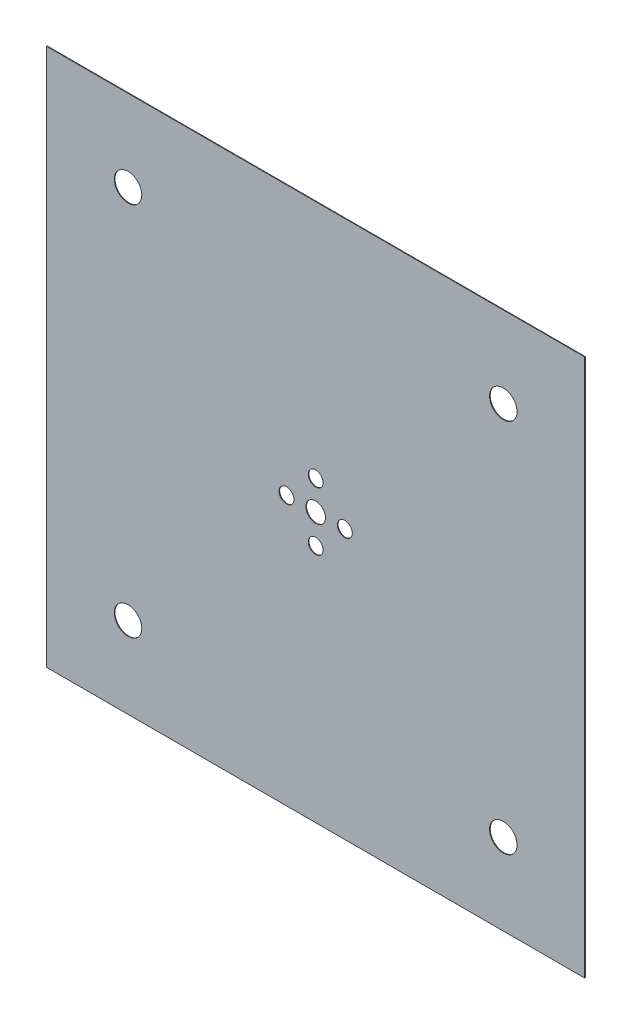
ISO-10303-21;
HEADER;
FILE_DESCRIPTION(('STEP AP214'),'2;1');
FILE_NAME('part.step','',(''),(''),'','','');
FILE_SCHEMA(('AUTOMOTIVE_DESIGN { 1 0 10303 214 1 1 1 1 }'));
ENDSEC;
DATA;
#1=APPLICATION_CONTEXT('core data for automotive mechanical design processes');
#2=APPLICATION_PROTOCOL_DEFINITION('international standard','automotive_design',2000,#1);
#3=PRODUCT_CONTEXT('',#1,'mechanical');
#4=PRODUCT('Part','Part','',(#3));
#5=PRODUCT_RELATED_PRODUCT_CATEGORY('part','',(#4));
#6=PRODUCT_DEFINITION_FORMATION('','',#4);
#7=PRODUCT_DEFINITION_CONTEXT('part definition',#1,'design');
#8=PRODUCT_DEFINITION('design','',#6,#7);
#9=PRODUCT_DEFINITION_SHAPE('','',#8);
#10=(LENGTH_UNIT() NAMED_UNIT(*) SI_UNIT(.MILLI.,.METRE.));
#11=(NAMED_UNIT(*) PLANE_ANGLE_UNIT() SI_UNIT($,.RADIAN.));
#12=(NAMED_UNIT(*) SI_UNIT($,.STERADIAN.) SOLID_ANGLE_UNIT());
#13=UNCERTAINTY_MEASURE_WITH_UNIT(LENGTH_MEASURE(1.E-05),#10,'distance_accuracy_value','');
#14=(GEOMETRIC_REPRESENTATION_CONTEXT(3) GLOBAL_UNCERTAINTY_ASSIGNED_CONTEXT((#13)) GLOBAL_UNIT_ASSIGNED_CONTEXT((#10,
#11,#12)) REPRESENTATION_CONTEXT('',''));
#15=CARTESIAN_POINT('',(0.,0.,0.));
#16=DIRECTION('',(0.,0.,1.));
#17=DIRECTION('',(1.,0.,0.));
#18=AXIS2_PLACEMENT_3D('',#15,#16,#17);
#19=CARTESIAN_POINT('',(0.,0.,3.));
#20=DIRECTION('',(0.,0.,1.));
#21=DIRECTION('',(1.,0.,0.));
#22=AXIS2_PLACEMENT_3D('',#19,#20,#21);
#23=PLANE('',#22);
#24=CARTESIAN_POINT('',(5.82867087928207E-13,-140.,3.));
#25=DIRECTION('',(0.,0.,1.));
#26=DIRECTION('',(1.,0.,0.));
#27=AXIS2_PLACEMENT_3D('',#24,#25,#26);
#28=CIRCLE('',#27,35.6375000000004);
#29=CARTESIAN_POINT('',(35.637500000001,-140.,3.));
#30=VERTEX_POINT('',#29);
#31=EDGE_CURVE('E157',#30,#30,#28,.T.);
#32=ORIENTED_EDGE('',*,*,#31,.F.);
#33=EDGE_LOOP('',(#32));
#34=FACE_BOUND('',#33,.T.);
#35=CARTESIAN_POINT('',(900.,-900.,3.));
#36=DIRECTION('',(0.,0.,1.));
#37=DIRECTION('',(-1.,0.,0.));
#38=AXIS2_PLACEMENT_3D('',#35,#36,#37);
#39=CIRCLE('',#38,65.7999999999998);
#40=CARTESIAN_POINT('',(834.2,-900.,3.));
#41=VERTEX_POINT('',#40);
#42=EDGE_CURVE('E145',#41,#41,#39,.T.);
#43=ORIENTED_EDGE('',*,*,#42,.F.);
#44=EDGE_LOOP('',(#43));
#45=FACE_BOUND('',#44,.T.);
#46=CARTESIAN_POINT('',(899.999999999999,900.000000000001,3.));
#47=DIRECTION('',(0.,0.,1.));
#48=DIRECTION('',(-1.,0.,0.));
#49=AXIS2_PLACEMENT_3D('',#46,#47,#48);
#50=CIRCLE('',#49,65.8000000000001);
#51=CARTESIAN_POINT('',(834.199999999999,900.000000000001,3.));
#52=VERTEX_POINT('',#51);
#53=EDGE_CURVE('E133',#52,#52,#50,.T.);
#54=ORIENTED_EDGE('',*,*,#53,.F.);
#55=EDGE_LOOP('',(#54));
#56=FACE_BOUND('',#55,.T.);
#57=CARTESIAN_POINT('',(1.40834381901945E-13,140.,3.));
#58=DIRECTION('',(0.,0.,1.));
#59=DIRECTION('',(1.,0.,0.));
#60=AXIS2_PLACEMENT_3D('',#57,#58,#59);
#61=CIRCLE('',#60,35.6375);
#62=CARTESIAN_POINT('',(35.6375000000001,140.,3.));
#63=VERTEX_POINT('',#62);
#64=EDGE_CURVE('E121',#63,#63,#61,.T.);
#65=ORIENTED_EDGE('',*,*,#64,.F.);
#66=EDGE_LOOP('',(#65));
#67=FACE_BOUND('',#66,.T.);
#68=DIRECTION('',(0.,1.,0.));
#69=VECTOR('',#68,1.);
#70=CARTESIAN_POINT('',(1290.,1290.,3.));
#71=LINE('',#70,#69);
#72=CARTESIAN_POINT('',(1290.,-1290.,3.));
#73=VERTEX_POINT('',#72);
#74=CARTESIAN_POINT('',(1290.,1290.,3.));
#75=VERTEX_POINT('',#74);
#76=EDGE_CURVE('E91',#73,#75,#71,.T.);
#77=ORIENTED_EDGE('',*,*,#76,.T.);
#78=DIRECTION('',(-1.,0.,0.));
#79=VECTOR('',#78,1.);
#80=CARTESIAN_POINT('',(-1290.,1290.,3.));
#81=LINE('',#80,#79);
#82=CARTESIAN_POINT('',(-1290.,1290.,3.));
#83=VERTEX_POINT('',#82);
#84=EDGE_CURVE('E86',#75,#83,#81,.T.);
#85=ORIENTED_EDGE('',*,*,#84,.T.);
#86=DIRECTION('',(0.,-1.,0.));
#87=VECTOR('',#86,1.);
#88=CARTESIAN_POINT('',(-1290.,1290.,3.));
#89=LINE('',#88,#87);
#90=CARTESIAN_POINT('',(-1290.,-1290.,3.));
#91=VERTEX_POINT('',#90);
#92=EDGE_CURVE('E89',#83,#91,#89,.T.);
#93=ORIENTED_EDGE('',*,*,#92,.T.);
#94=DIRECTION('',(1.,0.,0.));
#95=VECTOR('',#94,1.);
#96=CARTESIAN_POINT('',(-1290.,-1290.,3.));
#97=LINE('',#96,#95);
#98=EDGE_CURVE('E56',#91,#73,#97,.T.);
#99=ORIENTED_EDGE('',*,*,#98,.T.);
#100=EDGE_LOOP('',(#77,#85,#93,#99));
#101=FACE_BOUND('',#100,.T.);
#102=CARTESIAN_POINT('',(0.,-2.22044604925031E-13,3.));
#103=DIRECTION('',(0.,0.,1.));
#104=DIRECTION('',(1.,0.,0.));
#105=AXIS2_PLACEMENT_3D('',#102,#103,#104);
#106=CIRCLE('',#105,46.75);
#107=CARTESIAN_POINT('',(46.75,-2.22044604925031E-13,3.));
#108=VERTEX_POINT('',#107);
#109=EDGE_CURVE('E106',#108,#108,#106,.T.);
#110=ORIENTED_EDGE('',*,*,#109,.F.);
#111=EDGE_LOOP('',(#110));
#112=FACE_BOUND('',#111,.T.);
#113=CARTESIAN_POINT('',(-900.,900.,3.));
#114=DIRECTION('',(0.,0.,1.));
#115=DIRECTION('',(1.,0.,0.));
#116=AXIS2_PLACEMENT_3D('',#113,#114,#115);
#117=CIRCLE('',#116,65.8000000000001);
#118=CARTESIAN_POINT('',(-834.2,900.,3.));
#119=VERTEX_POINT('',#118);
#120=EDGE_CURVE('E127',#119,#119,#117,.T.);
#121=ORIENTED_EDGE('',*,*,#120,.F.);
#122=EDGE_LOOP('',(#121));
#123=FACE_BOUND('',#122,.T.);
#124=CARTESIAN_POINT('',(139.999999999999,-5.55111512312578E-13,3.));
#125=DIRECTION('',(0.,0.,1.));
#126=DIRECTION('',(-1.,0.,0.));
#127=AXIS2_PLACEMENT_3D('',#124,#125,#126);
#128=CIRCLE('',#127,35.6374999999999);
#129=CARTESIAN_POINT('',(104.362499999999,-5.55111512312578E-13,3.));
#130=VERTEX_POINT('',#129);
#131=EDGE_CURVE('E139',#130,#130,#128,.T.);
#132=ORIENTED_EDGE('',*,*,#131,.F.);
#133=EDGE_LOOP('',(#132));
#134=FACE_BOUND('',#133,.T.);
#135=CARTESIAN_POINT('',(-900.000000000001,-899.999999999999,3.));
#136=DIRECTION('',(0.,0.,1.));
#137=DIRECTION('',(1.,0.,0.));
#138=AXIS2_PLACEMENT_3D('',#135,#136,#137);
#139=CIRCLE('',#138,65.7999999999996);
#140=CARTESIAN_POINT('',(-834.200000000002,-899.999999999999,3.));
#141=VERTEX_POINT('',#140);
#142=EDGE_CURVE('E151',#141,#141,#139,.T.);
#143=ORIENTED_EDGE('',*,*,#142,.F.);
#144=EDGE_LOOP('',(#143));
#145=FACE_BOUND('',#144,.T.);
#146=CARTESIAN_POINT('',(-140.,-5.55111512312578E-13,3.));
#147=DIRECTION('',(0.,0.,1.));
#148=DIRECTION('',(-1.,0.,0.));
#149=AXIS2_PLACEMENT_3D('',#146,#147,#148);
#150=CIRCLE('',#149,35.6375000000002);
#151=CARTESIAN_POINT('',(-175.6375,-5.55111512312578E-13,3.));
#152=VERTEX_POINT('',#151);
#153=EDGE_CURVE('E163',#152,#152,#150,.T.);
#154=ORIENTED_EDGE('',*,*,#153,.F.);
#155=EDGE_LOOP('',(#154));
#156=FACE_BOUND('',#155,.T.);
#157=ADVANCED_FACE('F39',(#34,#45,#56,#67,#101,#112,#123,#134,#145,#156),#23,.T.);
#158=CARTESIAN_POINT('',(0.,0.,0.));
#159=DIRECTION('',(0.,0.,1.));
#160=DIRECTION('',(1.,0.,0.));
#161=AXIS2_PLACEMENT_3D('',#158,#159,#160);
#162=PLANE('',#161);
#163=DIRECTION('',(0.,1.,0.));
#164=VECTOR('',#163,1.);
#165=CARTESIAN_POINT('',(1290.,1290.,0.));
#166=LINE('',#165,#164);
#167=CARTESIAN_POINT('',(1290.,-1290.,0.));
#168=VERTEX_POINT('',#167);
#169=CARTESIAN_POINT('',(1290.,1290.,0.));
#170=VERTEX_POINT('',#169);
#171=EDGE_CURVE('E103',#168,#170,#166,.T.);
#172=ORIENTED_EDGE('',*,*,#171,.F.);
#173=DIRECTION('',(1.,0.,0.));
#174=VECTOR('',#173,1.);
#175=CARTESIAN_POINT('',(-1290.,-1290.,0.));
#176=LINE('',#175,#174);
#177=CARTESIAN_POINT('',(-1290.,-1290.,0.));
#178=VERTEX_POINT('',#177);
#179=EDGE_CURVE('E79',#178,#168,#176,.T.);
#180=ORIENTED_EDGE('',*,*,#179,.F.);
#181=DIRECTION('',(0.,-1.,0.));
#182=VECTOR('',#181,1.);
#183=CARTESIAN_POINT('',(-1290.,1290.,0.));
#184=LINE('',#183,#182);
#185=CARTESIAN_POINT('',(-1290.,1290.,0.));
#186=VERTEX_POINT('',#185);
#187=EDGE_CURVE('E73',#186,#178,#184,.T.);
#188=ORIENTED_EDGE('',*,*,#187,.F.);
#189=DIRECTION('',(-1.,0.,0.));
#190=VECTOR('',#189,1.);
#191=CARTESIAN_POINT('',(-1290.,1290.,0.));
#192=LINE('',#191,#190);
#193=EDGE_CURVE('E95',#170,#186,#192,.T.);
#194=ORIENTED_EDGE('',*,*,#193,.F.);
#195=EDGE_LOOP('',(#172,#180,#188,#194));
#196=FACE_BOUND('',#195,.T.);
#197=CARTESIAN_POINT('',(0.,-2.22044604925031E-13,0.));
#198=DIRECTION('',(0.,0.,1.));
#199=DIRECTION('',(1.,0.,0.));
#200=AXIS2_PLACEMENT_3D('',#197,#198,#199);
#201=CIRCLE('',#200,46.75);
#202=CARTESIAN_POINT('',(46.75,-2.22044604925031E-13,0.));
#203=VERTEX_POINT('',#202);
#204=EDGE_CURVE('E118',#203,#203,#201,.T.);
#205=ORIENTED_EDGE('',*,*,#204,.T.);
#206=EDGE_LOOP('',(#205));
#207=FACE_BOUND('',#206,.T.);
#208=CARTESIAN_POINT('',(1.40834381901945E-13,140.,0.));
#209=DIRECTION('',(0.,0.,1.));
#210=DIRECTION('',(1.,0.,0.));
#211=AXIS2_PLACEMENT_3D('',#208,#209,#210);
#212=CIRCLE('',#211,35.6375);
#213=CARTESIAN_POINT('',(35.6375000000001,140.,0.));
#214=VERTEX_POINT('',#213);
#215=EDGE_CURVE('E124',#214,#214,#212,.T.);
#216=ORIENTED_EDGE('',*,*,#215,.T.);
#217=EDGE_LOOP('',(#216));
#218=FACE_BOUND('',#217,.T.);
#219=CARTESIAN_POINT('',(-900.,900.,0.));
#220=DIRECTION('',(0.,0.,1.));
#221=DIRECTION('',(1.,0.,0.));
#222=AXIS2_PLACEMENT_3D('',#219,#220,#221);
#223=CIRCLE('',#222,65.8000000000001);
#224=CARTESIAN_POINT('',(-834.2,900.,0.));
#225=VERTEX_POINT('',#224);
#226=EDGE_CURVE('E130',#225,#225,#223,.T.);
#227=ORIENTED_EDGE('',*,*,#226,.T.);
#228=EDGE_LOOP('',(#227));
#229=FACE_BOUND('',#228,.T.);
#230=CARTESIAN_POINT('',(899.999999999999,900.000000000001,0.));
#231=DIRECTION('',(0.,0.,1.));
#232=DIRECTION('',(-1.,0.,0.));
#233=AXIS2_PLACEMENT_3D('',#230,#231,#232);
#234=CIRCLE('',#233,65.8000000000001);
#235=CARTESIAN_POINT('',(834.199999999999,900.000000000001,0.));
#236=VERTEX_POINT('',#235);
#237=EDGE_CURVE('E136',#236,#236,#234,.T.);
#238=ORIENTED_EDGE('',*,*,#237,.T.);
#239=EDGE_LOOP('',(#238));
#240=FACE_BOUND('',#239,.T.);
#241=CARTESIAN_POINT('',(139.999999999999,-5.55111512312578E-13,0.));
#242=DIRECTION('',(0.,0.,1.));
#243=DIRECTION('',(-1.,0.,0.));
#244=AXIS2_PLACEMENT_3D('',#241,#242,#243);
#245=CIRCLE('',#244,35.6374999999999);
#246=CARTESIAN_POINT('',(104.362499999999,-5.55111512312578E-13,0.));
#247=VERTEX_POINT('',#246);
#248=EDGE_CURVE('E142',#247,#247,#245,.T.);
#249=ORIENTED_EDGE('',*,*,#248,.T.);
#250=EDGE_LOOP('',(#249));
#251=FACE_BOUND('',#250,.T.);
#252=CARTESIAN_POINT('',(900.,-900.,0.));
#253=DIRECTION('',(0.,0.,1.));
#254=DIRECTION('',(-1.,0.,0.));
#255=AXIS2_PLACEMENT_3D('',#252,#253,#254);
#256=CIRCLE('',#255,65.7999999999998);
#257=CARTESIAN_POINT('',(834.2,-900.,0.));
#258=VERTEX_POINT('',#257);
#259=EDGE_CURVE('E148',#258,#258,#256,.T.);
#260=ORIENTED_EDGE('',*,*,#259,.T.);
#261=EDGE_LOOP('',(#260));
#262=FACE_BOUND('',#261,.T.);
#263=CARTESIAN_POINT('',(-900.000000000001,-899.999999999999,0.));
#264=DIRECTION('',(0.,0.,1.));
#265=DIRECTION('',(1.,0.,0.));
#266=AXIS2_PLACEMENT_3D('',#263,#264,#265);
#267=CIRCLE('',#266,65.7999999999996);
#268=CARTESIAN_POINT('',(-834.200000000002,-899.999999999999,0.));
#269=VERTEX_POINT('',#268);
#270=EDGE_CURVE('E154',#269,#269,#267,.T.);
#271=ORIENTED_EDGE('',*,*,#270,.T.);
#272=EDGE_LOOP('',(#271));
#273=FACE_BOUND('',#272,.T.);
#274=CARTESIAN_POINT('',(5.82867087928207E-13,-140.,0.));
#275=DIRECTION('',(0.,0.,1.));
#276=DIRECTION('',(1.,0.,0.));
#277=AXIS2_PLACEMENT_3D('',#274,#275,#276);
#278=CIRCLE('',#277,35.6375000000004);
#279=CARTESIAN_POINT('',(35.637500000001,-140.,0.));
#280=VERTEX_POINT('',#279);
#281=EDGE_CURVE('E160',#280,#280,#278,.T.);
#282=ORIENTED_EDGE('',*,*,#281,.T.);
#283=EDGE_LOOP('',(#282));
#284=FACE_BOUND('',#283,.T.);
#285=CARTESIAN_POINT('',(-140.,-5.55111512312578E-13,0.));
#286=DIRECTION('',(0.,0.,1.));
#287=DIRECTION('',(-1.,0.,0.));
#288=AXIS2_PLACEMENT_3D('',#285,#286,#287);
#289=CIRCLE('',#288,35.6375000000002);
#290=CARTESIAN_POINT('',(-175.6375,-5.55111512312578E-13,0.));
#291=VERTEX_POINT('',#290);
#292=EDGE_CURVE('E166',#291,#291,#289,.T.);
#293=ORIENTED_EDGE('',*,*,#292,.T.);
#294=EDGE_LOOP('',(#293));
#295=FACE_BOUND('',#294,.T.);
#296=ADVANCED_FACE('F114',(#196,#207,#218,#229,#240,#251,#262,#273,#284,#295),#162,.F.);
#297=CARTESIAN_POINT('',(1290.,1290.,3.));
#298=DIRECTION('',(-1.,0.,0.));
#299=DIRECTION('',(0.,-1.,0.));
#300=AXIS2_PLACEMENT_3D('',#297,#298,#299);
#301=PLANE('',#300);
#302=ORIENTED_EDGE('',*,*,#171,.T.);
#303=DIRECTION('',(0.,0.,-1.));
#304=VECTOR('',#303,1.);
#305=CARTESIAN_POINT('',(1290.,1290.,3.));
#306=LINE('',#305,#304);
#307=EDGE_CURVE('E11',#75,#170,#306,.T.);
#308=ORIENTED_EDGE('',*,*,#307,.F.);
#309=ORIENTED_EDGE('',*,*,#76,.F.);
#310=DIRECTION('',(0.,0.,-1.));
#311=VECTOR('',#310,1.);
#312=CARTESIAN_POINT('',(1290.,-1290.,3.));
#313=LINE('',#312,#311);
#314=EDGE_CURVE('E99',#73,#168,#313,.T.);
#315=ORIENTED_EDGE('',*,*,#314,.T.);
#316=EDGE_LOOP('',(#302,#308,#309,#315));
#317=FACE_BOUND('',#316,.T.);
#318=ADVANCED_FACE('F41',(#317),#301,.F.);
#319=CARTESIAN_POINT('',(-1290.,1290.,3.));
#320=DIRECTION('',(0.,-1.,0.));
#321=DIRECTION('',(0.,0.,-1.));
#322=AXIS2_PLACEMENT_3D('',#319,#320,#321);
#323=PLANE('',#322);
#324=ORIENTED_EDGE('',*,*,#193,.T.);
#325=DIRECTION('',(0.,0.,-1.));
#326=VECTOR('',#325,1.);
#327=CARTESIAN_POINT('',(-1290.,1290.,3.));
#328=LINE('',#327,#326);
#329=EDGE_CURVE('E48',#83,#186,#328,.T.);
#330=ORIENTED_EDGE('',*,*,#329,.F.);
#331=ORIENTED_EDGE('',*,*,#84,.F.);
#332=ORIENTED_EDGE('',*,*,#307,.T.);
#333=EDGE_LOOP('',(#324,#330,#331,#332));
#334=FACE_BOUND('',#333,.T.);
#335=ADVANCED_FACE('F94',(#334),#323,.F.);
#336=CARTESIAN_POINT('',(-1290.,1290.,3.));
#337=DIRECTION('',(1.,0.,0.));
#338=DIRECTION('',(0.,1.,0.));
#339=AXIS2_PLACEMENT_3D('',#336,#337,#338);
#340=PLANE('',#339);
#341=ORIENTED_EDGE('',*,*,#187,.T.);
#342=DIRECTION('',(0.,0.,-1.));
#343=VECTOR('',#342,1.);
#344=CARTESIAN_POINT('',(-1290.,-1290.,3.));
#345=LINE('',#344,#343);
#346=EDGE_CURVE('E96',#91,#178,#345,.T.);
#347=ORIENTED_EDGE('',*,*,#346,.F.);
#348=ORIENTED_EDGE('',*,*,#92,.F.);
#349=ORIENTED_EDGE('',*,*,#329,.T.);
#350=EDGE_LOOP('',(#341,#347,#348,#349));
#351=FACE_BOUND('',#350,.T.);
#352=ADVANCED_FACE('F97',(#351),#340,.F.);
#353=CARTESIAN_POINT('',(-1290.,-1290.,3.));
#354=DIRECTION('',(0.,1.,0.));
#355=DIRECTION('',(0.,0.,1.));
#356=AXIS2_PLACEMENT_3D('',#353,#354,#355);
#357=PLANE('',#356);
#358=ORIENTED_EDGE('',*,*,#179,.T.);
#359=ORIENTED_EDGE('',*,*,#314,.F.);
#360=ORIENTED_EDGE('',*,*,#98,.F.);
#361=ORIENTED_EDGE('',*,*,#346,.T.);
#362=EDGE_LOOP('',(#358,#359,#360,#361));
#363=FACE_BOUND('',#362,.T.);
#364=ADVANCED_FACE('F111',(#363),#357,.F.);
#365=CARTESIAN_POINT('',(0.,-2.22044604925031E-13,3.));
#366=DIRECTION('',(0.,0.,-1.));
#367=DIRECTION('',(-1.,0.,0.));
#368=AXIS2_PLACEMENT_3D('',#365,#366,#367);
#369=CYLINDRICAL_SURFACE('',#368,46.75);
#370=ORIENTED_EDGE('',*,*,#109,.T.);
#371=EDGE_LOOP('',(#370));
#372=FACE_BOUND('',#371,.T.);
#373=ORIENTED_EDGE('',*,*,#204,.F.);
#374=EDGE_LOOP('',(#373));
#375=FACE_BOUND('',#374,.T.);
#376=ADVANCED_FACE('F185',(#372,#375),#369,.F.);
#377=CARTESIAN_POINT('',(1.40834381901945E-13,140.,3.));
#378=DIRECTION('',(0.,0.,-1.));
#379=DIRECTION('',(-1.,0.,0.));
#380=AXIS2_PLACEMENT_3D('',#377,#378,#379);
#381=CYLINDRICAL_SURFACE('',#380,35.6375);
#382=ORIENTED_EDGE('',*,*,#64,.T.);
#383=EDGE_LOOP('',(#382));
#384=FACE_BOUND('',#383,.T.);
#385=ORIENTED_EDGE('',*,*,#215,.F.);
#386=EDGE_LOOP('',(#385));
#387=FACE_BOUND('',#386,.T.);
#388=ADVANCED_FACE('F239',(#384,#387),#381,.F.);
#389=CARTESIAN_POINT('',(-900.,900.,3.));
#390=DIRECTION('',(0.,0.,-1.));
#391=DIRECTION('',(-1.,0.,0.));
#392=AXIS2_PLACEMENT_3D('',#389,#390,#391);
#393=CYLINDRICAL_SURFACE('',#392,65.8000000000001);
#394=ORIENTED_EDGE('',*,*,#120,.T.);
#395=EDGE_LOOP('',(#394));
#396=FACE_BOUND('',#395,.T.);
#397=ORIENTED_EDGE('',*,*,#226,.F.);
#398=EDGE_LOOP('',(#397));
#399=FACE_BOUND('',#398,.T.);
#400=ADVANCED_FACE('F248',(#396,#399),#393,.F.);
#401=CARTESIAN_POINT('',(899.999999999999,900.000000000001,3.));
#402=DIRECTION('',(0.,0.,-1.));
#403=DIRECTION('',(-1.,0.,0.));
#404=AXIS2_PLACEMENT_3D('',#401,#402,#403);
#405=CYLINDRICAL_SURFACE('',#404,65.8000000000001);
#406=ORIENTED_EDGE('',*,*,#53,.T.);
#407=EDGE_LOOP('',(#406));
#408=FACE_BOUND('',#407,.T.);
#409=ORIENTED_EDGE('',*,*,#237,.F.);
#410=EDGE_LOOP('',(#409));
#411=FACE_BOUND('',#410,.T.);
#412=ADVANCED_FACE('F257',(#408,#411),#405,.F.);
#413=CARTESIAN_POINT('',(139.999999999999,-5.55111512312578E-13,3.));
#414=DIRECTION('',(0.,0.,-1.));
#415=DIRECTION('',(-1.,0.,0.));
#416=AXIS2_PLACEMENT_3D('',#413,#414,#415);
#417=CYLINDRICAL_SURFACE('',#416,35.6374999999999);
#418=ORIENTED_EDGE('',*,*,#131,.T.);
#419=EDGE_LOOP('',(#418));
#420=FACE_BOUND('',#419,.T.);
#421=ORIENTED_EDGE('',*,*,#248,.F.);
#422=EDGE_LOOP('',(#421));
#423=FACE_BOUND('',#422,.T.);
#424=ADVANCED_FACE('F267',(#420,#423),#417,.F.);
#425=CARTESIAN_POINT('',(900.,-900.,3.));
#426=DIRECTION('',(0.,0.,-1.));
#427=DIRECTION('',(-1.,0.,0.));
#428=AXIS2_PLACEMENT_3D('',#425,#426,#427);
#429=CYLINDRICAL_SURFACE('',#428,65.7999999999998);
#430=ORIENTED_EDGE('',*,*,#42,.T.);
#431=EDGE_LOOP('',(#430));
#432=FACE_BOUND('',#431,.T.);
#433=ORIENTED_EDGE('',*,*,#259,.F.);
#434=EDGE_LOOP('',(#433));
#435=FACE_BOUND('',#434,.T.);
#436=ADVANCED_FACE('F277',(#432,#435),#429,.F.);
#437=CARTESIAN_POINT('',(-900.000000000001,-899.999999999999,3.));
#438=DIRECTION('',(0.,0.,-1.));
#439=DIRECTION('',(-1.,0.,0.));
#440=AXIS2_PLACEMENT_3D('',#437,#438,#439);
#441=CYLINDRICAL_SURFACE('',#440,65.7999999999996);
#442=ORIENTED_EDGE('',*,*,#142,.T.);
#443=EDGE_LOOP('',(#442));
#444=FACE_BOUND('',#443,.T.);
#445=ORIENTED_EDGE('',*,*,#270,.F.);
#446=EDGE_LOOP('',(#445));
#447=FACE_BOUND('',#446,.T.);
#448=ADVANCED_FACE('F287',(#444,#447),#441,.F.);
#449=CARTESIAN_POINT('',(5.82867087928207E-13,-140.,3.));
#450=DIRECTION('',(0.,0.,-1.));
#451=DIRECTION('',(-1.,0.,0.));
#452=AXIS2_PLACEMENT_3D('',#449,#450,#451);
#453=CYLINDRICAL_SURFACE('',#452,35.6375000000004);
#454=ORIENTED_EDGE('',*,*,#31,.T.);
#455=EDGE_LOOP('',(#454));
#456=FACE_BOUND('',#455,.T.);
#457=ORIENTED_EDGE('',*,*,#281,.F.);
#458=EDGE_LOOP('',(#457));
#459=FACE_BOUND('',#458,.T.);
#460=ADVANCED_FACE('F297',(#456,#459),#453,.F.);
#461=CARTESIAN_POINT('',(-140.,-5.55111512312578E-13,3.));
#462=DIRECTION('',(0.,0.,-1.));
#463=DIRECTION('',(-1.,0.,0.));
#464=AXIS2_PLACEMENT_3D('',#461,#462,#463);
#465=CYLINDRICAL_SURFACE('',#464,35.6375000000002);
#466=ORIENTED_EDGE('',*,*,#153,.T.);
#467=EDGE_LOOP('',(#466));
#468=FACE_BOUND('',#467,.T.);
#469=ORIENTED_EDGE('',*,*,#292,.F.);
#470=EDGE_LOOP('',(#469));
#471=FACE_BOUND('',#470,.T.);
#472=ADVANCED_FACE('F172',(#468,#471),#465,.F.);
#473=CLOSED_SHELL('',(#157,#296,#318,#335,#352,#364,#376,#388,#400,#412,#424,#436,#448,#460,#472));
#474=MANIFOLD_SOLID_BREP('B2',#473);
#475=ADVANCED_BREP_SHAPE_REPRESENTATION('',(#18,#474),#14);
#476=SHAPE_DEFINITION_REPRESENTATION(#9,#475);
ENDSEC;
END-ISO-10303-21;
